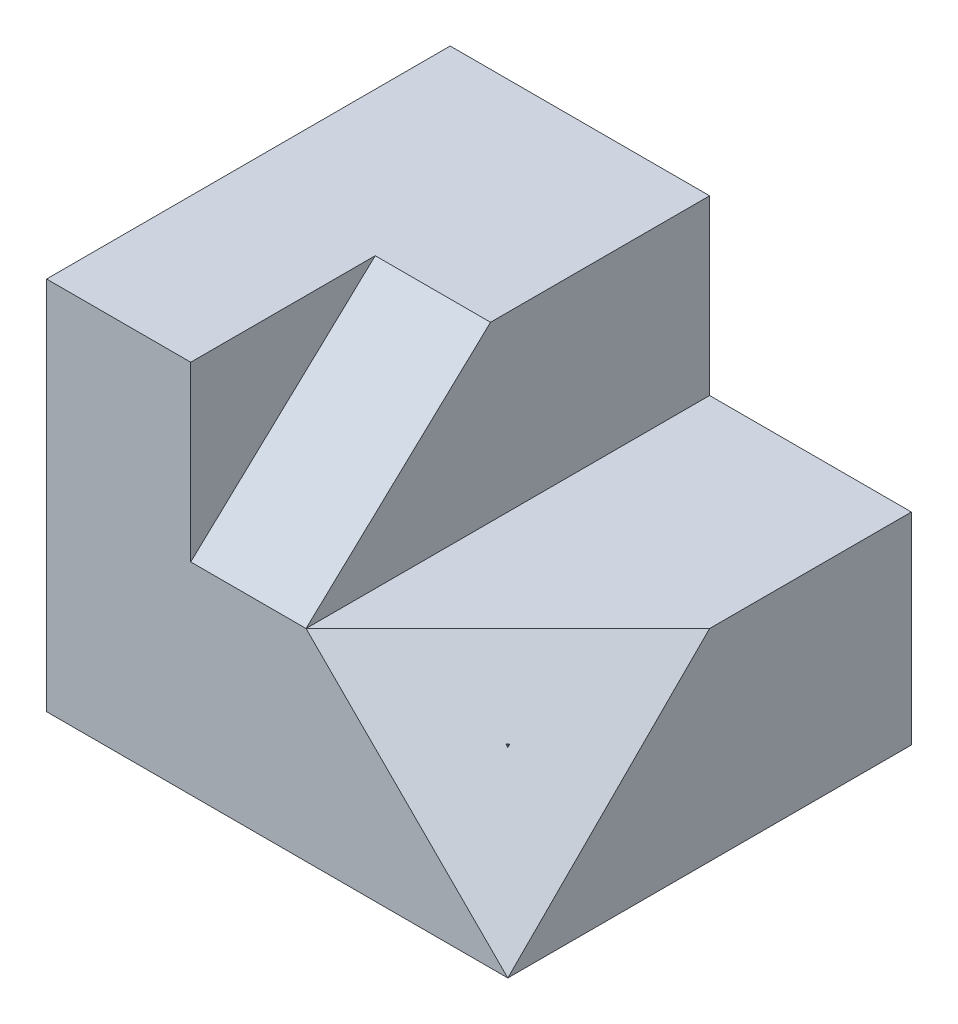
ISO-10303-21;
HEADER;
FILE_DESCRIPTION(('STEP AP214'),'2;1');
FILE_NAME('part.step','',(''),(''),'','','');
FILE_SCHEMA(('AUTOMOTIVE_DESIGN { 1 0 10303 214 1 1 1 1 }'));
ENDSEC;
DATA;
#1=APPLICATION_CONTEXT('core data for automotive mechanical design processes');
#2=APPLICATION_PROTOCOL_DEFINITION('international standard','automotive_design',2000,#1);
#3=PRODUCT_CONTEXT('',#1,'mechanical');
#4=PRODUCT('Part','Part','',(#3));
#5=PRODUCT_RELATED_PRODUCT_CATEGORY('part','',(#4));
#6=PRODUCT_DEFINITION_FORMATION('','',#4);
#7=PRODUCT_DEFINITION_CONTEXT('part definition',#1,'design');
#8=PRODUCT_DEFINITION('design','',#6,#7);
#9=PRODUCT_DEFINITION_SHAPE('','',#8);
#10=(LENGTH_UNIT() NAMED_UNIT(*) SI_UNIT(.MILLI.,.METRE.));
#11=(NAMED_UNIT(*) PLANE_ANGLE_UNIT() SI_UNIT($,.RADIAN.));
#12=(NAMED_UNIT(*) SI_UNIT($,.STERADIAN.) SOLID_ANGLE_UNIT());
#13=UNCERTAINTY_MEASURE_WITH_UNIT(LENGTH_MEASURE(1.E-05),#10,'distance_accuracy_value','');
#14=(GEOMETRIC_REPRESENTATION_CONTEXT(3) GLOBAL_UNCERTAINTY_ASSIGNED_CONTEXT((#13)) GLOBAL_UNIT_ASSIGNED_CONTEXT((#10,
#11,#12)) REPRESENTATION_CONTEXT('',''));
#15=CARTESIAN_POINT('',(0.,0.,0.));
#16=DIRECTION('',(0.,0.,1.));
#17=DIRECTION('',(1.,0.,0.));
#18=AXIS2_PLACEMENT_3D('',#15,#16,#17);
#19=CARTESIAN_POINT('',(40.,65.,35.));
#20=DIRECTION('',(0.,0.,-1.));
#21=DIRECTION('',(-1.,0.,0.));
#22=AXIS2_PLACEMENT_3D('',#19,#20,#21);
#23=PLANE('',#22);
#24=DIRECTION('',(-0.707106781186548,0.707106781186548,0.));
#25=VECTOR('',#24,1.);
#26=CARTESIAN_POINT('',(5.,35.,35.));
#27=LINE('',#26,#25);
#28=CARTESIAN_POINT('',(40.,0.,35.));
#29=VERTEX_POINT('',#28);
#30=CARTESIAN_POINT('',(5.,35.,35.));
#31=VERTEX_POINT('',#30);
#32=EDGE_CURVE('E129',#29,#31,#27,.T.);
#33=ORIENTED_EDGE('',*,*,#32,.T.);
#34=DIRECTION('',(1.,0.,0.));
#35=VECTOR('',#34,1.);
#36=CARTESIAN_POINT('',(-15.,35.,35.));
#37=LINE('',#36,#35);
#38=CARTESIAN_POINT('',(-15.,35.,35.));
#39=VERTEX_POINT('',#38);
#40=EDGE_CURVE('E113',#39,#31,#37,.T.);
#41=ORIENTED_EDGE('',*,*,#40,.F.);
#42=DIRECTION('',(0.,-1.,0.));
#43=VECTOR('',#42,1.);
#44=CARTESIAN_POINT('',(-15.,65.,35.));
#45=LINE('',#44,#43);
#46=CARTESIAN_POINT('',(-15.,65.,35.));
#47=VERTEX_POINT('',#46);
#48=EDGE_CURVE('E120',#47,#39,#45,.T.);
#49=ORIENTED_EDGE('',*,*,#48,.F.);
#50=DIRECTION('',(1.,0.,0.));
#51=VECTOR('',#50,1.);
#52=CARTESIAN_POINT('',(40.,65.,35.));
#53=LINE('',#52,#51);
#54=CARTESIAN_POINT('',(-40.,65.,35.));
#55=VERTEX_POINT('',#54);
#56=EDGE_CURVE('E175',#55,#47,#53,.T.);
#57=ORIENTED_EDGE('',*,*,#56,.F.);
#58=DIRECTION('',(0.,-1.,0.));
#59=VECTOR('',#58,1.);
#60=CARTESIAN_POINT('',(-40.,65.,35.));
#61=LINE('',#60,#59);
#62=CARTESIAN_POINT('',(-40.,0.,35.));
#63=VERTEX_POINT('',#62);
#64=EDGE_CURVE('E149',#55,#63,#61,.T.);
#65=ORIENTED_EDGE('',*,*,#64,.T.);
#66=DIRECTION('',(1.,0.,0.));
#67=VECTOR('',#66,1.);
#68=CARTESIAN_POINT('',(40.,0.,35.));
#69=LINE('',#68,#67);
#70=EDGE_CURVE('E146',#63,#29,#69,.T.);
#71=ORIENTED_EDGE('',*,*,#70,.T.);
#72=EDGE_LOOP('',(#33,#41,#49,#57,#65,#71));
#73=FACE_BOUND('',#72,.T.);
#74=ADVANCED_FACE('F49',(#73),#23,.F.);
#75=CARTESIAN_POINT('',(40.,65.,35.));
#76=DIRECTION('',(-1.,0.,0.));
#77=DIRECTION('',(0.,0.,1.));
#78=AXIS2_PLACEMENT_3D('',#75,#76,#77);
#79=PLANE('',#78);
#80=DIRECTION('',(0.,-0.707106781186548,0.707106781186548));
#81=VECTOR('',#80,1.);
#82=CARTESIAN_POINT('',(40.,0.,35.));
#83=LINE('',#82,#81);
#84=CARTESIAN_POINT('',(40.,35.,0.));
#85=VERTEX_POINT('',#84);
#86=EDGE_CURVE('E71',#85,#29,#83,.T.);
#87=ORIENTED_EDGE('',*,*,#86,.T.);
#88=DIRECTION('',(0.,0.,-1.));
#89=VECTOR('',#88,1.);
#90=CARTESIAN_POINT('',(40.,0.,35.));
#91=LINE('',#90,#89);
#92=CARTESIAN_POINT('',(40.,0.,-35.));
#93=VERTEX_POINT('',#92);
#94=EDGE_CURVE('E145',#29,#93,#91,.T.);
#95=ORIENTED_EDGE('',*,*,#94,.T.);
#96=DIRECTION('',(0.,-1.,0.));
#97=VECTOR('',#96,1.);
#98=CARTESIAN_POINT('',(40.,65.,-35.));
#99=LINE('',#98,#97);
#100=CARTESIAN_POINT('',(40.,35.,-35.));
#101=VERTEX_POINT('',#100);
#102=EDGE_CURVE('E158',#101,#93,#99,.T.);
#103=ORIENTED_EDGE('',*,*,#102,.F.);
#104=DIRECTION('',(0.,0.,-1.));
#105=VECTOR('',#104,1.);
#106=CARTESIAN_POINT('',(40.,35.,35.));
#107=LINE('',#106,#105);
#108=EDGE_CURVE('E52',#85,#101,#107,.T.);
#109=ORIENTED_EDGE('',*,*,#108,.F.);
#110=EDGE_LOOP('',(#87,#95,#103,#109));
#111=FACE_BOUND('',#110,.T.);
#112=ADVANCED_FACE('F215',(#111),#79,.F.);
#113=CARTESIAN_POINT('',(5.,35.,35.));
#114=DIRECTION('',(0.,-1.,0.));
#115=DIRECTION('',(0.,0.,-1.));
#116=AXIS2_PLACEMENT_3D('',#113,#114,#115);
#117=PLANE('',#116);
#118=DIRECTION('',(0.707106781186548,0.,-0.707106781186548));
#119=VECTOR('',#118,1.);
#120=CARTESIAN_POINT('',(40.,35.,0.));
#121=LINE('',#120,#119);
#122=EDGE_CURVE('E66',#31,#85,#121,.T.);
#123=ORIENTED_EDGE('',*,*,#122,.T.);
#124=ORIENTED_EDGE('',*,*,#108,.T.);
#125=DIRECTION('',(1.,0.,0.));
#126=VECTOR('',#125,1.);
#127=CARTESIAN_POINT('',(5.,35.,-35.));
#128=LINE('',#127,#126);
#129=CARTESIAN_POINT('',(5.,35.,-35.));
#130=VERTEX_POINT('',#129);
#131=EDGE_CURVE('E162',#130,#101,#128,.T.);
#132=ORIENTED_EDGE('',*,*,#131,.F.);
#133=DIRECTION('',(0.,0.,-1.));
#134=VECTOR('',#133,1.);
#135=CARTESIAN_POINT('',(5.,35.,35.));
#136=LINE('',#135,#134);
#137=EDGE_CURVE('E138',#31,#130,#136,.T.);
#138=ORIENTED_EDGE('',*,*,#137,.F.);
#139=EDGE_LOOP('',(#123,#124,#132,#138));
#140=FACE_BOUND('',#139,.T.);
#141=ADVANCED_FACE('F218',(#140),#117,.F.);
#142=CARTESIAN_POINT('',(0.,65.,0.));
#143=DIRECTION('',(0.,1.,0.));
#144=DIRECTION('',(0.,0.,1.));
#145=AXIS2_PLACEMENT_3D('',#142,#143,#144);
#146=PLANE('',#145);
#147=DIRECTION('',(1.,0.,0.));
#148=VECTOR('',#147,1.);
#149=CARTESIAN_POINT('',(-15.,65.,2.99999999999999));
#150=LINE('',#149,#148);
#151=CARTESIAN_POINT('',(-15.,65.,2.99999999999999));
#152=VERTEX_POINT('',#151);
#153=CARTESIAN_POINT('',(5.,65.,2.99999999999999));
#154=VERTEX_POINT('',#153);
#155=EDGE_CURVE('E116',#152,#154,#150,.T.);
#156=ORIENTED_EDGE('',*,*,#155,.T.);
#157=DIRECTION('',(0.,0.,1.));
#158=VECTOR('',#157,1.);
#159=CARTESIAN_POINT('',(5.,65.,35.));
#160=LINE('',#159,#158);
#161=CARTESIAN_POINT('',(5.,65.,-35.));
#162=VERTEX_POINT('',#161);
#163=EDGE_CURVE('E134',#162,#154,#160,.T.);
#164=ORIENTED_EDGE('',*,*,#163,.F.);
#165=DIRECTION('',(-1.,0.,0.));
#166=VECTOR('',#165,1.);
#167=CARTESIAN_POINT('',(40.,65.,-35.));
#168=LINE('',#167,#166);
#169=CARTESIAN_POINT('',(-40.,65.,-35.));
#170=VERTEX_POINT('',#169);
#171=EDGE_CURVE('E141',#162,#170,#168,.T.);
#172=ORIENTED_EDGE('',*,*,#171,.T.);
#173=DIRECTION('',(0.,0.,1.));
#174=VECTOR('',#173,1.);
#175=CARTESIAN_POINT('',(-40.,65.,35.));
#176=LINE('',#175,#174);
#177=EDGE_CURVE('E178',#170,#55,#176,.T.);
#178=ORIENTED_EDGE('',*,*,#177,.T.);
#179=ORIENTED_EDGE('',*,*,#56,.T.);
#180=DIRECTION('',(0.,0.,1.));
#181=VECTOR('',#180,1.);
#182=CARTESIAN_POINT('',(-15.,65.,2.99999999999999));
#183=LINE('',#182,#181);
#184=EDGE_CURVE('E12',#152,#47,#183,.T.);
#185=ORIENTED_EDGE('',*,*,#184,.F.);
#186=EDGE_LOOP('',(#156,#164,#172,#178,#179,#185));
#187=FACE_BOUND('',#186,.T.);
#188=ADVANCED_FACE('F206',(#187),#146,.T.);
#189=CARTESIAN_POINT('',(-40.,65.,35.));
#190=DIRECTION('',(1.,0.,0.));
#191=DIRECTION('',(0.,0.,-1.));
#192=AXIS2_PLACEMENT_3D('',#189,#190,#191);
#193=PLANE('',#192);
#194=DIRECTION('',(0.,0.,1.));
#195=VECTOR('',#194,1.);
#196=CARTESIAN_POINT('',(-40.,0.,35.));
#197=LINE('',#196,#195);
#198=CARTESIAN_POINT('',(-40.,0.,-35.));
#199=VERTEX_POINT('',#198);
#200=EDGE_CURVE('E167',#199,#63,#197,.T.);
#201=ORIENTED_EDGE('',*,*,#200,.T.);
#202=ORIENTED_EDGE('',*,*,#64,.F.);
#203=ORIENTED_EDGE('',*,*,#177,.F.);
#204=DIRECTION('',(0.,-1.,0.));
#205=VECTOR('',#204,1.);
#206=CARTESIAN_POINT('',(-40.,65.,-35.));
#207=LINE('',#206,#205);
#208=EDGE_CURVE('E163',#170,#199,#207,.T.);
#209=ORIENTED_EDGE('',*,*,#208,.T.);
#210=EDGE_LOOP('',(#201,#202,#203,#209));
#211=FACE_BOUND('',#210,.T.);
#212=ADVANCED_FACE('F208',(#211),#193,.F.);
#213=CARTESIAN_POINT('',(40.,65.,-35.));
#214=DIRECTION('',(0.,0.,1.));
#215=DIRECTION('',(1.,0.,0.));
#216=AXIS2_PLACEMENT_3D('',#213,#214,#215);
#217=PLANE('',#216);
#218=DIRECTION('',(0.,1.,0.));
#219=VECTOR('',#218,1.);
#220=CARTESIAN_POINT('',(5.,65.,-35.));
#221=LINE('',#220,#219);
#222=EDGE_CURVE('E189',#130,#162,#221,.T.);
#223=ORIENTED_EDGE('',*,*,#222,.F.);
#224=ORIENTED_EDGE('',*,*,#131,.T.);
#225=ORIENTED_EDGE('',*,*,#102,.T.);
#226=DIRECTION('',(-1.,0.,0.));
#227=VECTOR('',#226,1.);
#228=CARTESIAN_POINT('',(40.,0.,-35.));
#229=LINE('',#228,#227);
#230=EDGE_CURVE('E161',#93,#199,#229,.T.);
#231=ORIENTED_EDGE('',*,*,#230,.T.);
#232=ORIENTED_EDGE('',*,*,#208,.F.);
#233=ORIENTED_EDGE('',*,*,#171,.F.);
#234=EDGE_LOOP('',(#223,#224,#225,#231,#232,#233));
#235=FACE_BOUND('',#234,.T.);
#236=ADVANCED_FACE('F201',(#235),#217,.F.);
#237=CARTESIAN_POINT('',(0.,0.,0.));
#238=DIRECTION('',(0.,1.,0.));
#239=DIRECTION('',(0.,0.,1.));
#240=AXIS2_PLACEMENT_3D('',#237,#238,#239);
#241=PLANE('',#240);
#242=ORIENTED_EDGE('',*,*,#200,.F.);
#243=ORIENTED_EDGE('',*,*,#230,.F.);
#244=ORIENTED_EDGE('',*,*,#94,.F.);
#245=ORIENTED_EDGE('',*,*,#70,.F.);
#246=EDGE_LOOP('',(#242,#243,#244,#245));
#247=FACE_BOUND('',#246,.T.);
#248=ADVANCED_FACE('F212',(#247),#241,.F.);
#249=CARTESIAN_POINT('',(5.,0.,0.));
#250=DIRECTION('',(1.,0.,0.));
#251=DIRECTION('',(0.,0.,-1.));
#252=AXIS2_PLACEMENT_3D('',#249,#250,#251);
#253=PLANE('',#252);
#254=DIRECTION('',(0.,0.68394112888133,-0.729537204140085));
#255=VECTOR('',#254,1.);
#256=CARTESIAN_POINT('',(5.,35.,35.));
#257=LINE('',#256,#255);
#258=EDGE_CURVE('E131',#31,#154,#257,.T.);
#259=ORIENTED_EDGE('',*,*,#258,.F.);
#260=ORIENTED_EDGE('',*,*,#137,.T.);
#261=ORIENTED_EDGE('',*,*,#222,.T.);
#262=ORIENTED_EDGE('',*,*,#163,.T.);
#263=EDGE_LOOP('',(#259,#260,#261,#262));
#264=FACE_BOUND('',#263,.T.);
#265=ADVANCED_FACE('F197',(#264),#253,.T.);
#266=CARTESIAN_POINT('',(-15.,35.,35.));
#267=DIRECTION('',(0.,-0.729537204140085,-0.68394112888133));
#268=DIRECTION('',(0.,0.68394112888133,-0.729537204140085));
#269=AXIS2_PLACEMENT_3D('',#266,#267,#268);
#270=PLANE('',#269);
#271=ORIENTED_EDGE('',*,*,#258,.T.);
#272=ORIENTED_EDGE('',*,*,#155,.F.);
#273=DIRECTION('',(0.,0.68394112888133,-0.729537204140085));
#274=VECTOR('',#273,1.);
#275=CARTESIAN_POINT('',(-15.,35.,35.));
#276=LINE('',#275,#274);
#277=EDGE_CURVE('E58',#39,#152,#276,.T.);
#278=ORIENTED_EDGE('',*,*,#277,.F.);
#279=ORIENTED_EDGE('',*,*,#40,.T.);
#280=EDGE_LOOP('',(#271,#272,#278,#279));
#281=FACE_BOUND('',#280,.T.);
#282=ADVANCED_FACE('F111',(#281),#270,.F.);
#283=CARTESIAN_POINT('',(-15.,0.,0.));
#284=DIRECTION('',(-1.,0.,0.));
#285=DIRECTION('',(0.,0.,1.));
#286=AXIS2_PLACEMENT_3D('',#283,#284,#285);
#287=PLANE('',#286);
#288=ORIENTED_EDGE('',*,*,#48,.T.);
#289=ORIENTED_EDGE('',*,*,#277,.T.);
#290=ORIENTED_EDGE('',*,*,#184,.T.);
#291=EDGE_LOOP('',(#288,#289,#290));
#292=FACE_BOUND('',#291,.T.);
#293=ADVANCED_FACE('F123',(#292),#287,.F.);
#294=CARTESIAN_POINT('',(25.,25.,25.));
#295=DIRECTION('',(0.577350269189626,0.577350269189626,0.577350269189626));
#296=DIRECTION('',(0.707106781186548,0.,-0.707106781186547));
#297=AXIS2_PLACEMENT_3D('',#294,#295,#296);
#298=PLANE('',#297);
#299=ORIENTED_EDGE('',*,*,#32,.F.);
#300=ORIENTED_EDGE('',*,*,#86,.F.);
#301=ORIENTED_EDGE('',*,*,#122,.F.);
#302=EDGE_LOOP('',(#299,#300,#301));
#303=FACE_BOUND('',#302,.T.);
#304=ADVANCED_FACE('F293',(#303),#298,.T.);
#305=CLOSED_SHELL('',(#74,#112,#141,#188,#212,#236,#248,#265,#282,#293,#304));
#306=MANIFOLD_SOLID_BREP('B2',#305);
#307=CARTESIAN_POINT('',(5.,35.,35.));
#308=DIRECTION('',(0.,-1.,0.));
#309=DIRECTION('',(0.,0.,-1.));
#310=AXIS2_PLACEMENT_3D('',#307,#308,#309);
#311=PLANE('',#310);
#312=DIRECTION('',(0.,0.,-1.));
#313=VECTOR('',#312,1.);
#314=CARTESIAN_POINT('',(40.,35.,35.));
#315=LINE('',#314,#313);
#316=CARTESIAN_POINT('',(40.,35.,35.));
#317=VERTEX_POINT('',#316);
#318=CARTESIAN_POINT('',(40.,35.,34.6410161513775));
#319=VERTEX_POINT('',#318);
#320=EDGE_CURVE('E341',#317,#319,#315,.T.);
#321=ORIENTED_EDGE('',*,*,#320,.T.);
#322=DIRECTION('',(-0.707106781186548,0.,0.707106781186547));
#323=VECTOR('',#322,1.);
#324=CARTESIAN_POINT('',(22.3205080756888,35.,52.3205080756888));
#325=LINE('',#324,#323);
#326=CARTESIAN_POINT('',(39.6410161513776,35.,35.));
#327=VERTEX_POINT('',#326);
#328=EDGE_CURVE('E47',#319,#327,#325,.T.);
#329=ORIENTED_EDGE('',*,*,#328,.T.);
#330=DIRECTION('',(1.,0.,0.));
#331=VECTOR('',#330,1.);
#332=CARTESIAN_POINT('',(5.,35.,35.));
#333=LINE('',#332,#331);
#334=EDGE_CURVE('E330',#327,#317,#333,.T.);
#335=ORIENTED_EDGE('',*,*,#334,.T.);
#336=EDGE_LOOP('',(#321,#329,#335));
#337=FACE_BOUND('',#336,.T.);
#338=ADVANCED_FACE('F309',(#337),#311,.F.);
#339=CARTESIAN_POINT('',(40.,65.,35.));
#340=DIRECTION('',(-1.,0.,0.));
#341=DIRECTION('',(0.,0.,1.));
#342=AXIS2_PLACEMENT_3D('',#339,#340,#341);
#343=PLANE('',#342);
#344=DIRECTION('',(0.,-1.,0.));
#345=VECTOR('',#344,1.);
#346=CARTESIAN_POINT('',(40.,65.,35.));
#347=LINE('',#346,#345);
#348=CARTESIAN_POINT('',(40.,34.6410161513776,35.));
#349=VERTEX_POINT('',#348);
#350=EDGE_CURVE('E317',#317,#349,#347,.T.);
#351=ORIENTED_EDGE('',*,*,#350,.T.);
#352=DIRECTION('',(0.,0.707106781186548,-0.707106781186547));
#353=VECTOR('',#352,1.);
#354=CARTESIAN_POINT('',(40.,49.8205080756888,19.8205080756888));
#355=LINE('',#354,#353);
#356=EDGE_CURVE('E337',#349,#319,#355,.T.);
#357=ORIENTED_EDGE('',*,*,#356,.T.);
#358=ORIENTED_EDGE('',*,*,#320,.F.);
#359=EDGE_LOOP('',(#351,#357,#358));
#360=FACE_BOUND('',#359,.T.);
#361=ADVANCED_FACE('F340',(#360),#343,.F.);
#362=CARTESIAN_POINT('',(40.,65.,35.));
#363=DIRECTION('',(0.,0.,-1.));
#364=DIRECTION('',(-1.,0.,0.));
#365=AXIS2_PLACEMENT_3D('',#362,#363,#364);
#366=PLANE('',#365);
#367=ORIENTED_EDGE('',*,*,#334,.F.);
#368=DIRECTION('',(0.707106781186547,-0.707106781186547,0.));
#369=VECTOR('',#368,1.);
#370=CARTESIAN_POINT('',(24.8205080756888,49.8205080756888,35.));
#371=LINE('',#370,#369);
#372=EDGE_CURVE('E324',#327,#349,#371,.T.);
#373=ORIENTED_EDGE('',*,*,#372,.T.);
#374=ORIENTED_EDGE('',*,*,#350,.F.);
#375=EDGE_LOOP('',(#367,#373,#374));
#376=FACE_BOUND('',#375,.T.);
#377=ADVANCED_FACE('F311',(#376),#366,.F.);
#378=CARTESIAN_POINT('',(36.5470053837925,36.5470053837925,36.5470053837925));
#379=DIRECTION('',(0.577350269189626,0.577350269189626,0.577350269189626));
#380=DIRECTION('',(0.707106781186548,0.,-0.707106781186547));
#381=AXIS2_PLACEMENT_3D('',#378,#379,#380);
#382=PLANE('',#381);
#383=ORIENTED_EDGE('',*,*,#328,.F.);
#384=ORIENTED_EDGE('',*,*,#356,.F.);
#385=ORIENTED_EDGE('',*,*,#372,.F.);
#386=EDGE_LOOP('',(#383,#384,#385));
#387=FACE_BOUND('',#386,.T.);
#388=ADVANCED_FACE('F336',(#387),#382,.F.);
#389=CLOSED_SHELL('',(#338,#361,#377,#388));
#390=MANIFOLD_SOLID_BREP('B6',#389);
#391=ADVANCED_BREP_SHAPE_REPRESENTATION('',(#18,#306,#390),#14);
#392=SHAPE_DEFINITION_REPRESENTATION(#9,#391);
ENDSEC;
END-ISO-10303-21;
